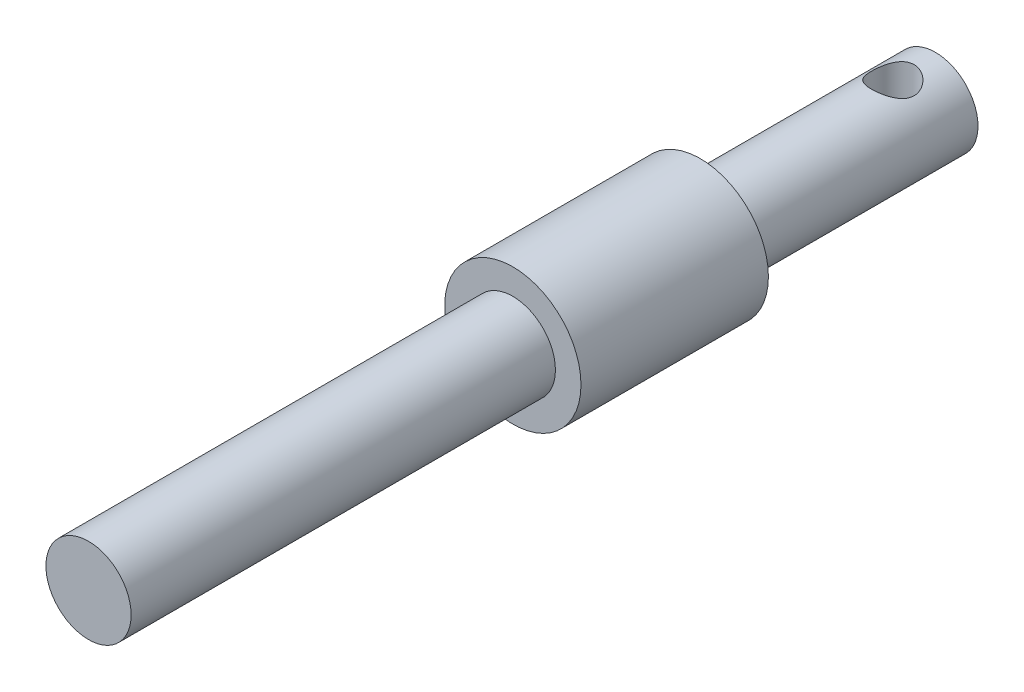
ISO-10303-21;
HEADER;
FILE_DESCRIPTION(('STEP AP214'),'2;1');
FILE_NAME('part.step','',(''),(''),'','','');
FILE_SCHEMA(('AUTOMOTIVE_DESIGN { 1 0 10303 214 1 1 1 1 }'));
ENDSEC;
DATA;
#1=APPLICATION_CONTEXT('core data for automotive mechanical design processes');
#2=APPLICATION_PROTOCOL_DEFINITION('international standard','automotive_design',2000,#1);
#3=PRODUCT_CONTEXT('',#1,'mechanical');
#4=PRODUCT('Part','Part','',(#3));
#5=PRODUCT_RELATED_PRODUCT_CATEGORY('part','',(#4));
#6=PRODUCT_DEFINITION_FORMATION('','',#4);
#7=PRODUCT_DEFINITION_CONTEXT('part definition',#1,'design');
#8=PRODUCT_DEFINITION('design','',#6,#7);
#9=PRODUCT_DEFINITION_SHAPE('','',#8);
#10=(LENGTH_UNIT() NAMED_UNIT(*) SI_UNIT(.MILLI.,.METRE.));
#11=(NAMED_UNIT(*) PLANE_ANGLE_UNIT() SI_UNIT($,.RADIAN.));
#12=(NAMED_UNIT(*) SI_UNIT($,.STERADIAN.) SOLID_ANGLE_UNIT());
#13=UNCERTAINTY_MEASURE_WITH_UNIT(LENGTH_MEASURE(1.E-05),#10,'distance_accuracy_value','');
#14=(GEOMETRIC_REPRESENTATION_CONTEXT(3) GLOBAL_UNCERTAINTY_ASSIGNED_CONTEXT((#13)) GLOBAL_UNIT_ASSIGNED_CONTEXT((#10,
#11,#12)) REPRESENTATION_CONTEXT('',''));
#15=CARTESIAN_POINT('',(0.,0.,0.));
#16=DIRECTION('',(0.,0.,1.));
#17=DIRECTION('',(1.,0.,0.));
#18=AXIS2_PLACEMENT_3D('',#15,#16,#17);
#19=CARTESIAN_POINT('',(0.,0.,13.8));
#20=DIRECTION('',(0.,0.,-1.));
#21=DIRECTION('',(-1.,0.,0.));
#22=AXIS2_PLACEMENT_3D('',#19,#20,#21);
#23=CYLINDRICAL_SURFACE('',#22,2.5);
#24=CARTESIAN_POINT('',(0.,-2.5,3.75));
#25=CARTESIAN_POINT('',(0.0657149536912331,-2.49999641755188,3.74999587210062));
#26=CARTESIAN_POINT('',(0.131508249622541,-2.49738113774397,3.74478740859791));
#27=CARTESIAN_POINT('',(0.261150294085531,-2.48717695046745,3.72418389957385));
#28=CARTESIAN_POINT('',(0.32499510839188,-2.47957859786229,3.70876950875294));
#29=CARTESIAN_POINT('',(0.448666931100718,-2.46020349254139,3.66850773922901));
#30=CARTESIAN_POINT('',(0.508508503673975,-2.448442989719,3.64369701968998));
#31=CARTESIAN_POINT('',(0.623090771008206,-2.42182220644723,3.58553672329382));
#32=CARTESIAN_POINT('',(0.677831867487563,-2.40696217041913,3.55218781968893));
#33=CARTESIAN_POINT('',(0.784384772202399,-2.37445322822571,3.47560343814338));
#34=CARTESIAN_POINT('',(0.83581901390264,-2.3566899890942,3.43189190095045));
#35=CARTESIAN_POINT('',(0.930974306083722,-2.3207496280843,3.33684815094121));
#36=CARTESIAN_POINT('',(0.974689478883458,-2.30257220261294,3.28551018528445));
#37=CARTESIAN_POINT('',(1.05656500056285,-2.26623688996684,3.17189581309577));
#38=CARTESIAN_POINT('',(1.09403166943955,-2.24818983712665,3.10907987706761));
#39=CARTESIAN_POINT('',(1.15771028361337,-2.21607473465401,2.97704083001723));
#40=CARTESIAN_POINT('',(1.18393026870792,-2.20200384508737,2.90782233909656));
#41=CARTESIAN_POINT('',(1.22266555273574,-2.18072333797261,2.7691686182226));
#42=CARTESIAN_POINT('',(1.23590732135055,-2.17315339479642,2.69999443491576));
#43=CARTESIAN_POINT('',(1.25053374163606,-2.1647736243566,2.56002645277565));
#44=CARTESIAN_POINT('',(1.25193011046634,-2.1639571167911,2.48923432391106));
#45=CARTESIAN_POINT('',(1.24335910896537,-2.16888662821561,2.35714246960579));
#46=CARTESIAN_POINT('',(1.23473069942103,-2.17385954577517,2.29571996097119));
#47=CARTESIAN_POINT('',(1.20867481132117,-2.18845285917313,2.1753476132837));
#48=CARTESIAN_POINT('',(1.19124452987206,-2.1980747353972,2.11639856836836));
#49=CARTESIAN_POINT('',(1.1477622254825,-2.22109345515926,2.00096358429293));
#50=CARTESIAN_POINT('',(1.12151883389499,-2.23457300829998,1.94456700151776));
#51=CARTESIAN_POINT('',(1.061302109585,-2.26379255351755,1.83670713426249));
#52=CARTESIAN_POINT('',(1.02732530476558,-2.27953355975238,1.78524608049989));
#53=CARTESIAN_POINT('',(0.947582568640986,-2.31391447379107,1.68184843407097));
#54=CARTESIAN_POINT('',(0.900868072961602,-2.33266887795933,1.6306789080298));
#55=CARTESIAN_POINT('',(0.799444473426717,-2.36934529125509,1.53658072676137));
#56=CARTESIAN_POINT('',(0.744731570717857,-2.38726689948501,1.49365600995765));
#57=CARTESIAN_POINT('',(0.625645632289811,-2.42127484103705,1.41539292371284));
#58=CARTESIAN_POINT('',(0.560941989499261,-2.43723730202509,1.38049940944282));
#59=CARTESIAN_POINT('',(0.425582769360996,-2.46447351401553,1.32237871369624));
#60=CARTESIAN_POINT('',(0.354931970331596,-2.47575098679441,1.29914226873104));
#61=CARTESIAN_POINT('',(0.215958114575877,-2.49155417176795,1.26690574535416));
#62=CARTESIAN_POINT('',(0.147926913185405,-2.4965617287664,1.25688595531653));
#63=CARTESIAN_POINT('',(0.0109744999366921,-2.50091266823877,1.24816908608189));
#64=CARTESIAN_POINT('',(-0.0579462748373765,-2.5002587340164,1.24946664295065));
#65=CARTESIAN_POINT('',(-0.189041214982492,-2.49363990316801,1.26275836052344));
#66=CARTESIAN_POINT('',(-0.251324260062442,-2.48809057110237,1.27391566591254));
#67=CARTESIAN_POINT('',(-0.373008615377395,-2.47277714143524,1.30529758986886));
#68=CARTESIAN_POINT('',(-0.432409607113746,-2.46301257917916,1.3255232080667));
#69=CARTESIAN_POINT('',(-0.548610760562082,-2.43980314267087,1.37499808304146));
#70=CARTESIAN_POINT('',(-0.605287996257692,-2.42626102212424,1.40448881264602));
#71=CARTESIAN_POINT('',(-0.713076702123651,-2.39679967896386,1.47138441955755));
#72=CARTESIAN_POINT('',(-0.764185787219103,-2.38087944457231,1.50879266824179));
#73=CARTESIAN_POINT('',(-0.864709611613316,-2.3463527667183,1.59470053166609));
#74=CARTESIAN_POINT('',(-0.913465097280799,-2.32763606060552,1.64392858556696));
#75=CARTESIAN_POINT('',(-1.00232040139155,-2.29077989504843,1.74990643908663));
#76=CARTESIAN_POINT('',(-1.04241423211355,-2.27264084226908,1.80666139852047));
#77=CARTESIAN_POINT('',(-1.11463489312212,-2.23813990282585,1.92955456775039));
#78=CARTESIAN_POINT('',(-1.1462818698483,-2.2219066207934,1.99601408276074));
#79=CARTESIAN_POINT('',(-1.19760353251725,-2.19467590460158,2.13438758461565));
#80=CARTESIAN_POINT('',(-1.21729364485946,-2.18367172800773,2.20629440812648));
#81=CARTESIAN_POINT('',(-1.2423271093121,-2.16951876260833,2.34613777857681));
#82=CARTESIAN_POINT('',(-1.24886624550108,-2.16571729325614,2.41379281678629));
#83=CARTESIAN_POINT('',(-1.25086144297598,-2.16456693307719,2.54930883396341));
#84=CARTESIAN_POINT('',(-1.2463223082805,-2.16721524534441,2.61716971092429));
#85=CARTESIAN_POINT('',(-1.22740765699033,-2.17797327562531,2.74435437691502));
#86=CARTESIAN_POINT('',(-1.2140103929285,-2.18553868102992,2.8038755876805));
#87=CARTESIAN_POINT('',(-1.17896919778081,-2.20463770234897,2.91976014928088));
#88=CARTESIAN_POINT('',(-1.15732261394976,-2.21617259462094,2.97612247761496));
#89=CARTESIAN_POINT('',(-1.10476968162585,-2.2428566295566,3.08828106373326));
#90=CARTESIAN_POINT('',(-1.07333892227057,-2.25819652995238,3.14378487728713));
#91=CARTESIAN_POINT('',(-1.00268871454579,-2.29044164543238,3.24909317022573));
#92=CARTESIAN_POINT('',(-0.963465214048311,-2.30734767243153,3.29889466314811));
#93=CARTESIAN_POINT('',(-0.872754158330802,-2.34327903949141,3.39767747794702));
#94=CARTESIAN_POINT('',(-0.820355528762714,-2.36231229139336,3.4458238779524));
#95=CARTESIAN_POINT('',(-0.70769350777535,-2.3984719031886,3.53282872927954));
#96=CARTESIAN_POINT('',(-0.647425904070981,-2.4155972326005,3.57168217428286));
#97=CARTESIAN_POINT('',(-0.519914496024933,-2.44622511981379,3.63904545345276));
#98=CARTESIAN_POINT('',(-0.452624379918267,-2.45970120703636,3.66748021176429));
#99=CARTESIAN_POINT('',(-0.313427626617739,-2.48126676704332,3.71226020989869));
#100=CARTESIAN_POINT('',(-0.241534749528957,-2.48937154216165,3.72863980853697));
#101=CARTESIAN_POINT('',(-0.140752433104229,-2.49619327387079,3.74237176384481));
#102=CARTESIAN_POINT('',(-0.112702349299373,-2.49761706674002,3.74522830107952));
#103=CARTESIAN_POINT('',(-0.0564396647589467,-2.49952121222331,3.74904333189601));
#104=CARTESIAN_POINT('',(-0.0282270595592265,-2.50000153879704,3.750001773089));
#105=CARTESIAN_POINT('',(0.,-2.5,3.75));
#106=B_SPLINE_CURVE_WITH_KNOTS('',3,(#24,#25,#26,#27,#28,#29,#30,#31,#32,#33,#34,#35,#36,#37,
#38,#39,#40,#41,#42,#43,#44,#45,#46,#47,#48,#49,#50,#51,#52,#53,#54,#55,#56,#57,#58,#59,#60,#61,
#62,#63,#64,#65,#66,#67,#68,#69,#70,#71,#72,#73,#74,#75,#76,#77,#78,#79,#80,#81,#82,#83,#84,#85,
#86,#87,#88,#89,#90,#91,#92,#93,#94,#95,#96,#97,#98,#99,#100,#101,#102,#103,#104,#105),
.UNSPECIFIED.,.T.,.F.,(4,2,2,2,2,2,2,2,2,2,2,2,2,2,2,2,2,2,2,2,2,2,2,2,2,2,2,2,2,2,2,2,2,2,2,2,
2,2,2,2,4),(0.,0.197030321775366,0.394435187136497,0.591077694365373,0.78770470072696,
0.996227198397611,1.20490779706754,1.42977158038441,1.65447434872851,1.86572515175287,
2.07676696661276,2.26257140511651,2.44843504907098,2.63862800210609,2.82890651575277,
3.04331176667348,3.25781918248358,3.48228777768051,3.70657771140349,3.91229113089182,
4.11790705639345,4.30758633132652,4.49728652038664,4.69241070034873,4.88761813435424,
5.10199513305523,5.3165198576929,5.54143352699593,5.76605639925972,5.96911634372967,
6.17208824825007,6.35572412805228,6.53941910979598,6.73545570969518,6.93159451423697,
7.15156553440623,7.37165479220716,7.59330017078656,7.81431135781163,7.89894100172122,
7.98357298143558),.UNSPECIFIED.);
#107=CARTESIAN_POINT('',(0.,-2.5,3.75));
#108=VERTEX_POINT('',#107);
#109=EDGE_CURVE('E47',#108,#108,#106,.T.);
#110=ORIENTED_EDGE('',*,*,#109,.T.);
#111=EDGE_LOOP('',(#110));
#112=FACE_BOUND('',#111,.T.);
#113=CARTESIAN_POINT('',(0.,2.5,3.75));
#114=CARTESIAN_POINT('',(-0.065714953691233,2.49999641755189,3.74999587210062));
#115=CARTESIAN_POINT('',(-0.13150824962254,2.49738113774397,3.74478740859791));
#116=CARTESIAN_POINT('',(-0.261150294085531,2.48717695046745,3.72418389957385));
#117=CARTESIAN_POINT('',(-0.324995108391879,2.47957859786229,3.70876950875294));
#118=CARTESIAN_POINT('',(-0.448666931100718,2.46020349254139,3.66850773922901));
#119=CARTESIAN_POINT('',(-0.508508503673975,2.448442989719,3.64369701968998));
#120=CARTESIAN_POINT('',(-0.623090771008206,2.42182220644723,3.58553672329382));
#121=CARTESIAN_POINT('',(-0.677831867487562,2.40696217041912,3.55218781968893));
#122=CARTESIAN_POINT('',(-0.784384772202399,2.37445322822571,3.47560343814338));
#123=CARTESIAN_POINT('',(-0.83581901390264,2.3566899890942,3.43189190095045));
#124=CARTESIAN_POINT('',(-0.930974306083721,2.3207496280843,3.33684815094121));
#125=CARTESIAN_POINT('',(-0.974689478883458,2.30257220261294,3.28551018528445));
#126=CARTESIAN_POINT('',(-1.05656500056285,2.26623688996684,3.17189581309577));
#127=CARTESIAN_POINT('',(-1.09403166943955,2.24818983712665,3.10907987706761));
#128=CARTESIAN_POINT('',(-1.15771028361337,2.21607473465401,2.97704083001723));
#129=CARTESIAN_POINT('',(-1.18393026870792,2.20200384508737,2.90782233909656));
#130=CARTESIAN_POINT('',(-1.22266555273574,2.18072333797261,2.7691686182226));
#131=CARTESIAN_POINT('',(-1.23590732135055,2.17315339479642,2.69999443491576));
#132=CARTESIAN_POINT('',(-1.25053374163606,2.1647736243566,2.56002645277565));
#133=CARTESIAN_POINT('',(-1.25193011046634,2.1639571167911,2.48923432391106));
#134=CARTESIAN_POINT('',(-1.24335910896537,2.16888662821561,2.35714246960579));
#135=CARTESIAN_POINT('',(-1.23473069942103,2.17385954577517,2.29571996097119));
#136=CARTESIAN_POINT('',(-1.20867481132117,2.18845285917313,2.1753476132837));
#137=CARTESIAN_POINT('',(-1.19124452987206,2.1980747353972,2.11639856836836));
#138=CARTESIAN_POINT('',(-1.1477622254825,2.22109345515926,2.00096358429293));
#139=CARTESIAN_POINT('',(-1.12151883389499,2.23457300829998,1.94456700151776));
#140=CARTESIAN_POINT('',(-1.061302109585,2.26379255351755,1.83670713426249));
#141=CARTESIAN_POINT('',(-1.02732530476558,2.27953355975238,1.78524608049989));
#142=CARTESIAN_POINT('',(-0.947582568640986,2.31391447379107,1.68184843407097));
#143=CARTESIAN_POINT('',(-0.900868072961603,2.33266887795933,1.6306789080298));
#144=CARTESIAN_POINT('',(-0.799444473426718,2.36934529125509,1.53658072676137));
#145=CARTESIAN_POINT('',(-0.744731570717858,2.38726689948501,1.49365600995765));
#146=CARTESIAN_POINT('',(-0.625645632289811,2.42127484103705,1.41539292371284));
#147=CARTESIAN_POINT('',(-0.560941989499262,2.43723730202509,1.38049940944283));
#148=CARTESIAN_POINT('',(-0.425582769360997,2.46447351401553,1.32237871369624));
#149=CARTESIAN_POINT('',(-0.354931970331597,2.47575098679441,1.29914226873104));
#150=CARTESIAN_POINT('',(-0.215958114575878,2.49155417176795,1.26690574535416));
#151=CARTESIAN_POINT('',(-0.147926913185406,2.4965617287664,1.25688595531653));
#152=CARTESIAN_POINT('',(-0.0109744999366928,2.50091266823877,1.24816908608189));
#153=CARTESIAN_POINT('',(0.0579462748373761,2.5002587340164,1.24946664295065));
#154=CARTESIAN_POINT('',(0.189041214982492,2.49363990316801,1.26275836052344));
#155=CARTESIAN_POINT('',(0.251324260062443,2.48809057110237,1.27391566591254));
#156=CARTESIAN_POINT('',(0.373008615377396,2.47277714143524,1.30529758986886));
#157=CARTESIAN_POINT('',(0.432409607113746,2.46301257917916,1.3255232080667));
#158=CARTESIAN_POINT('',(0.548610760562081,2.43980314267087,1.37499808304146));
#159=CARTESIAN_POINT('',(0.605287996257691,2.42626102212424,1.40448881264602));
#160=CARTESIAN_POINT('',(0.713076702123651,2.39679967896386,1.47138441955755));
#161=CARTESIAN_POINT('',(0.764185787219102,2.38087944457231,1.50879266824179));
#162=CARTESIAN_POINT('',(0.864709611613316,2.3463527667183,1.59470053166609));
#163=CARTESIAN_POINT('',(0.913465097280798,2.32763606060552,1.64392858556696));
#164=CARTESIAN_POINT('',(1.00232040139155,2.29077989504843,1.74990643908663));
#165=CARTESIAN_POINT('',(1.04241423211355,2.27264084226908,1.80666139852047));
#166=CARTESIAN_POINT('',(1.11463489312212,2.23813990282585,1.92955456775039));
#167=CARTESIAN_POINT('',(1.1462818698483,2.2219066207934,1.99601408276074));
#168=CARTESIAN_POINT('',(1.19760353251725,2.19467590460158,2.13438758461565));
#169=CARTESIAN_POINT('',(1.21729364485946,2.18367172800773,2.20629440812648));
#170=CARTESIAN_POINT('',(1.2423271093121,2.16951876260833,2.34613777857681));
#171=CARTESIAN_POINT('',(1.24886624550108,2.16571729325614,2.41379281678629));
#172=CARTESIAN_POINT('',(1.25086144297598,2.16456693307719,2.54930883396341));
#173=CARTESIAN_POINT('',(1.2463223082805,2.16721524534441,2.61716971092429));
#174=CARTESIAN_POINT('',(1.22740765699033,2.17797327562531,2.74435437691502));
#175=CARTESIAN_POINT('',(1.2140103929285,2.18553868102992,2.8038755876805));
#176=CARTESIAN_POINT('',(1.17896919778081,2.20463770234897,2.91976014928088));
#177=CARTESIAN_POINT('',(1.15732261394976,2.21617259462094,2.97612247761496));
#178=CARTESIAN_POINT('',(1.10476968162585,2.2428566295566,3.08828106373326));
#179=CARTESIAN_POINT('',(1.07333892227057,2.25819652995238,3.14378487728712));
#180=CARTESIAN_POINT('',(1.00268871454579,2.29044164543238,3.24909317022573));
#181=CARTESIAN_POINT('',(0.963465214048311,2.30734767243153,3.29889466314811));
#182=CARTESIAN_POINT('',(0.872754158330802,2.34327903949141,3.39767747794702));
#183=CARTESIAN_POINT('',(0.820355528762715,2.36231229139336,3.4458238779524));
#184=CARTESIAN_POINT('',(0.70769350777535,2.3984719031886,3.53282872927954));
#185=CARTESIAN_POINT('',(0.647425904070982,2.4155972326005,3.57168217428286));
#186=CARTESIAN_POINT('',(0.519914496024934,2.44622511981379,3.63904545345275));
#187=CARTESIAN_POINT('',(0.452624379918269,2.45970120703636,3.66748021176429));
#188=CARTESIAN_POINT('',(0.31342762661774,2.48126676704332,3.71226020989869));
#189=CARTESIAN_POINT('',(0.241534749528958,2.48937154216165,3.72863980853697));
#190=CARTESIAN_POINT('',(0.140752433104231,2.49619327387079,3.74237176384481));
#191=CARTESIAN_POINT('',(0.112702349299374,2.49761706674002,3.74522830107952));
#192=CARTESIAN_POINT('',(0.0564396647589479,2.49952121222331,3.74904333189601));
#193=CARTESIAN_POINT('',(0.0282270595592271,2.50000153879704,3.750001773089));
#194=CARTESIAN_POINT('',(0.,2.5,3.75));
#195=B_SPLINE_CURVE_WITH_KNOTS('',3,(#113,#114,#115,#116,#117,#118,#119,#120,#121,#122,#123,
#124,#125,#126,#127,#128,#129,#130,#131,#132,#133,#134,#135,#136,#137,#138,#139,#140,#141,#142,
#143,#144,#145,#146,#147,#148,#149,#150,#151,#152,#153,#154,#155,#156,#157,#158,#159,#160,#161,
#162,#163,#164,#165,#166,#167,#168,#169,#170,#171,#172,#173,#174,#175,#176,#177,#178,#179,#180,
#181,#182,#183,#184,#185,#186,#187,#188,#189,#190,#191,#192,#193,#194),.UNSPECIFIED.,.T.,.F.,(4,
2,2,2,2,2,2,2,2,2,2,2,2,2,2,2,2,2,2,2,2,2,2,2,2,2,2,2,2,2,2,2,2,2,2,2,2,2,2,2,4),(0.,
0.197030321775365,0.394435187136497,0.591077694365373,0.787704700726959,0.996227198397611,
1.20490779706754,1.42977158038441,1.65447434872851,1.86572515175287,2.07676696661276,
2.26257140511651,2.44843504907098,2.63862800210609,2.82890651575277,3.04331176667348,
3.25781918248358,3.48228777768051,3.70657771140349,3.91229113089182,4.11790705639345,
4.30758633132652,4.49728652038664,4.69241070034873,4.88761813435424,5.10199513305523,
5.3165198576929,5.54143352699592,5.76605639925972,5.96911634372967,6.17208824825006,
6.35572412805228,6.53941910979597,6.73545570969518,6.93159451423697,7.15156553440623,
7.37165479220716,7.59330017078656,7.81431135781163,7.89894100172122,7.98357298143558),.UNSPECIFIED.);
#196=CARTESIAN_POINT('',(0.,2.5,3.75));
#197=VERTEX_POINT('',#196);
#198=EDGE_CURVE('E79',#197,#197,#195,.T.);
#199=ORIENTED_EDGE('',*,*,#198,.T.);
#200=EDGE_LOOP('',(#199));
#201=FACE_BOUND('',#200,.T.);
#202=CARTESIAN_POINT('',(0.,0.,13.8));
#203=DIRECTION('',(0.,0.,1.));
#204=DIRECTION('',(1.,0.,0.));
#205=AXIS2_PLACEMENT_3D('',#202,#203,#204);
#206=CIRCLE('',#205,2.5);
#207=CARTESIAN_POINT('',(2.5,0.,13.8));
#208=VERTEX_POINT('',#207);
#209=EDGE_CURVE('E56',#208,#208,#206,.T.);
#210=ORIENTED_EDGE('',*,*,#209,.F.);
#211=EDGE_LOOP('',(#210));
#212=FACE_BOUND('',#211,.T.);
#213=CARTESIAN_POINT('',(0.,0.,0.));
#214=DIRECTION('',(0.,0.,1.));
#215=DIRECTION('',(1.,0.,0.));
#216=AXIS2_PLACEMENT_3D('',#213,#214,#215);
#217=CIRCLE('',#216,2.5);
#218=CARTESIAN_POINT('',(2.5,0.,0.));
#219=VERTEX_POINT('',#218);
#220=EDGE_CURVE('E64',#219,#219,#217,.T.);
#221=ORIENTED_EDGE('',*,*,#220,.T.);
#222=EDGE_LOOP('',(#221));
#223=FACE_BOUND('',#222,.T.);
#224=ADVANCED_FACE('F43',(#112,#201,#212,#223),#23,.T.);
#225=CARTESIAN_POINT('',(0.,0.,0.));
#226=DIRECTION('',(0.,0.,1.));
#227=DIRECTION('',(1.,0.,0.));
#228=AXIS2_PLACEMENT_3D('',#225,#226,#227);
#229=PLANE('',#228);
#230=ORIENTED_EDGE('',*,*,#220,.F.);
#231=EDGE_LOOP('',(#230));
#232=FACE_BOUND('',#231,.T.);
#233=ADVANCED_FACE('F109',(#232),#229,.F.);
#234=CARTESIAN_POINT('',(0.,0.,24.8));
#235=DIRECTION('',(0.,0.,-1.));
#236=DIRECTION('',(-1.,0.,0.));
#237=AXIS2_PLACEMENT_3D('',#234,#235,#236);
#238=CYLINDRICAL_SURFACE('',#237,4.);
#239=CARTESIAN_POINT('',(0.,0.,24.8));
#240=DIRECTION('',(0.,0.,1.));
#241=DIRECTION('',(1.,0.,0.));
#242=AXIS2_PLACEMENT_3D('',#239,#240,#241);
#243=CIRCLE('',#242,4.);
#244=CARTESIAN_POINT('',(4.,0.,24.8));
#245=VERTEX_POINT('',#244);
#246=EDGE_CURVE('E69',#245,#245,#243,.T.);
#247=ORIENTED_EDGE('',*,*,#246,.F.);
#248=EDGE_LOOP('',(#247));
#249=FACE_BOUND('',#248,.T.);
#250=CARTESIAN_POINT('',(0.,0.,13.8));
#251=DIRECTION('',(0.,0.,1.));
#252=DIRECTION('',(1.,0.,0.));
#253=AXIS2_PLACEMENT_3D('',#250,#251,#252);
#254=CIRCLE('',#253,4.);
#255=CARTESIAN_POINT('',(4.,0.,13.8));
#256=VERTEX_POINT('',#255);
#257=EDGE_CURVE('E73',#256,#256,#254,.T.);
#258=ORIENTED_EDGE('',*,*,#257,.T.);
#259=EDGE_LOOP('',(#258));
#260=FACE_BOUND('',#259,.T.);
#261=ADVANCED_FACE('F103',(#249,#260),#238,.T.);
#262=CARTESIAN_POINT('',(0.,0.,24.8));
#263=DIRECTION('',(0.,0.,1.));
#264=DIRECTION('',(1.,0.,0.));
#265=AXIS2_PLACEMENT_3D('',#262,#263,#264);
#266=PLANE('',#265);
#267=CARTESIAN_POINT('',(0.,0.,24.8));
#268=DIRECTION('',(0.,0.,1.));
#269=DIRECTION('',(1.,0.,0.));
#270=AXIS2_PLACEMENT_3D('',#267,#268,#269);
#271=CIRCLE('',#270,2.5);
#272=CARTESIAN_POINT('',(2.5,0.,24.8));
#273=VERTEX_POINT('',#272);
#274=EDGE_CURVE('E10',#273,#273,#271,.T.);
#275=ORIENTED_EDGE('',*,*,#274,.F.);
#276=EDGE_LOOP('',(#275));
#277=FACE_BOUND('',#276,.T.);
#278=ORIENTED_EDGE('',*,*,#246,.T.);
#279=EDGE_LOOP('',(#278));
#280=FACE_BOUND('',#279,.T.);
#281=ADVANCED_FACE('F100',(#277,#280),#266,.T.);
#282=CARTESIAN_POINT('',(0.,0.,13.8));
#283=DIRECTION('',(0.,0.,1.));
#284=DIRECTION('',(1.,0.,0.));
#285=AXIS2_PLACEMENT_3D('',#282,#283,#284);
#286=PLANE('',#285);
#287=ORIENTED_EDGE('',*,*,#209,.T.);
#288=EDGE_LOOP('',(#287));
#289=FACE_BOUND('',#288,.T.);
#290=ORIENTED_EDGE('',*,*,#257,.F.);
#291=EDGE_LOOP('',(#290));
#292=FACE_BOUND('',#291,.T.);
#293=ADVANCED_FACE('F98',(#289,#292),#286,.F.);
#294=CARTESIAN_POINT('',(0.,0.,49.7));
#295=DIRECTION('',(0.,0.,-1.));
#296=DIRECTION('',(-1.,0.,0.));
#297=AXIS2_PLACEMENT_3D('',#294,#295,#296);
#298=CYLINDRICAL_SURFACE('',#297,2.5);
#299=CARTESIAN_POINT('',(0.,0.,49.7));
#300=DIRECTION('',(0.,0.,1.));
#301=DIRECTION('',(1.,0.,0.));
#302=AXIS2_PLACEMENT_3D('',#299,#300,#301);
#303=CIRCLE('',#302,2.5);
#304=CARTESIAN_POINT('',(2.5,0.,49.7));
#305=VERTEX_POINT('',#304);
#306=EDGE_CURVE('E68',#305,#305,#303,.T.);
#307=ORIENTED_EDGE('',*,*,#306,.F.);
#308=EDGE_LOOP('',(#307));
#309=FACE_BOUND('',#308,.T.);
#310=ORIENTED_EDGE('',*,*,#274,.T.);
#311=EDGE_LOOP('',(#310));
#312=FACE_BOUND('',#311,.T.);
#313=ADVANCED_FACE('F94',(#309,#312),#298,.T.);
#314=CARTESIAN_POINT('',(0.,0.,49.7));
#315=DIRECTION('',(0.,0.,1.));
#316=DIRECTION('',(1.,0.,0.));
#317=AXIS2_PLACEMENT_3D('',#314,#315,#316);
#318=PLANE('',#317);
#319=ORIENTED_EDGE('',*,*,#306,.T.);
#320=EDGE_LOOP('',(#319));
#321=FACE_BOUND('',#320,.T.);
#322=ADVANCED_FACE('F89',(#321),#318,.T.);
#323=CARTESIAN_POINT('',(0.,-4.,2.5));
#324=DIRECTION('',(0.,1.,0.));
#325=DIRECTION('',(0.,0.,1.));
#326=AXIS2_PLACEMENT_3D('',#323,#324,#325);
#327=CYLINDRICAL_SURFACE('',#326,1.25);
#328=ORIENTED_EDGE('',*,*,#198,.F.);
#329=EDGE_LOOP('',(#328));
#330=FACE_BOUND('',#329,.T.);
#331=ORIENTED_EDGE('',*,*,#109,.F.);
#332=EDGE_LOOP('',(#331));
#333=FACE_BOUND('',#332,.T.);
#334=ADVANCED_FACE('F85',(#330,#333),#327,.F.);
#335=CLOSED_SHELL('',(#224,#233,#261,#281,#293,#313,#322,#334));
#336=MANIFOLD_SOLID_BREP('B2',#335);
#337=ADVANCED_BREP_SHAPE_REPRESENTATION('',(#18,#336),#14);
#338=SHAPE_DEFINITION_REPRESENTATION(#9,#337);
ENDSEC;
END-ISO-10303-21;
